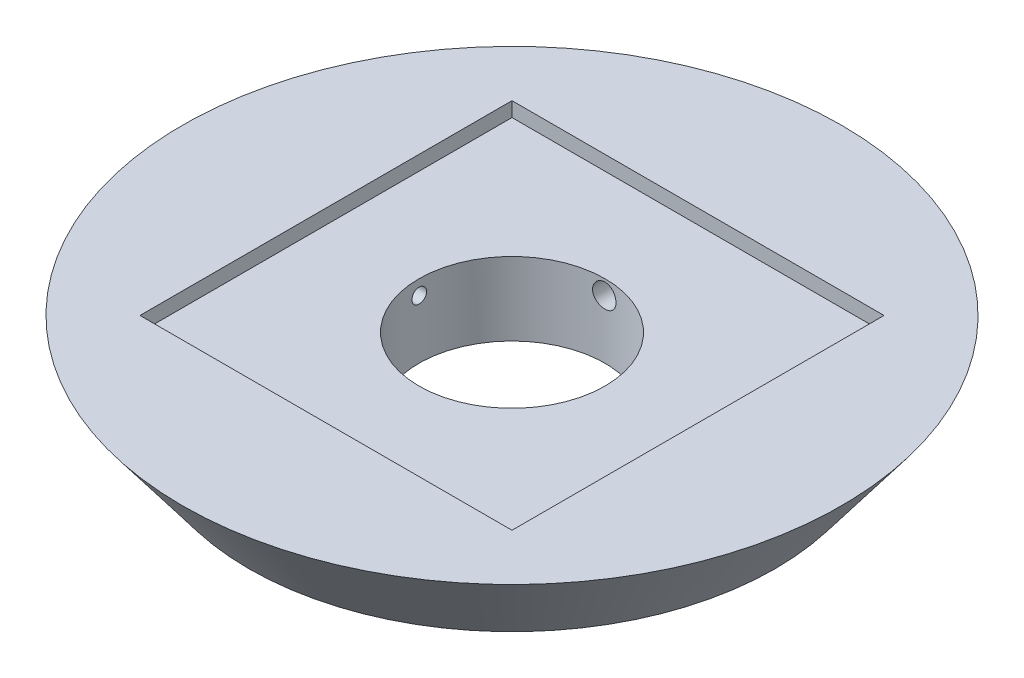
ISO-10303-21;
HEADER;
FILE_DESCRIPTION(('STEP AP214'),'2;1');
FILE_NAME('part.step','',(''),(''),'','','');
FILE_SCHEMA(('AUTOMOTIVE_DESIGN { 1 0 10303 214 1 1 1 1 }'));
ENDSEC;
DATA;
#1=APPLICATION_CONTEXT('core data for automotive mechanical design processes');
#2=APPLICATION_PROTOCOL_DEFINITION('international standard','automotive_design',2000,#1);
#3=PRODUCT_CONTEXT('',#1,'mechanical');
#4=PRODUCT('Part','Part','',(#3));
#5=PRODUCT_RELATED_PRODUCT_CATEGORY('part','',(#4));
#6=PRODUCT_DEFINITION_FORMATION('','',#4);
#7=PRODUCT_DEFINITION_CONTEXT('part definition',#1,'design');
#8=PRODUCT_DEFINITION('design','',#6,#7);
#9=PRODUCT_DEFINITION_SHAPE('','',#8);
#10=(LENGTH_UNIT() NAMED_UNIT(*) SI_UNIT(.MILLI.,.METRE.));
#11=(NAMED_UNIT(*) PLANE_ANGLE_UNIT() SI_UNIT($,.RADIAN.));
#12=(NAMED_UNIT(*) SI_UNIT($,.STERADIAN.) SOLID_ANGLE_UNIT());
#13=UNCERTAINTY_MEASURE_WITH_UNIT(LENGTH_MEASURE(1.E-05),#10,'distance_accuracy_value','');
#14=(GEOMETRIC_REPRESENTATION_CONTEXT(3) GLOBAL_UNCERTAINTY_ASSIGNED_CONTEXT((#13)) GLOBAL_UNIT_ASSIGNED_CONTEXT((#10,
#11,#12)) REPRESENTATION_CONTEXT('',''));
#15=CARTESIAN_POINT('',(0.,0.,0.));
#16=DIRECTION('',(0.,0.,1.));
#17=DIRECTION('',(1.,0.,0.));
#18=AXIS2_PLACEMENT_3D('',#15,#16,#17);
#19=CARTESIAN_POINT('',(0.,0.,0.));
#20=DIRECTION('',(0.,1.,0.));
#21=DIRECTION('',(0.,0.,1.));
#22=AXIS2_PLACEMENT_3D('',#19,#20,#21);
#23=CONICAL_SURFACE('',#22,17.96,0.647754140034402);
#24=CARTESIAN_POINT('',(-21.3203700201032,4.44269198535779,-0.23243021820478));
#25=CARTESIAN_POINT('',(-21.3097161610648,4.42898880694021,-0.258527704933812));
#26=CARTESIAN_POINT('',(-21.297481190965,4.41323547278915,-0.282908393542698));
#27=CARTESIAN_POINT('',(-21.2706260002389,4.37859909560427,-0.32782724997899));
#28=CARTESIAN_POINT('',(-21.2560018445095,4.35971088845442,-0.348358956472008));
#29=CARTESIAN_POINT('',(-21.2251610791585,4.31980157411314,-0.385305046362523));
#30=CARTESIAN_POINT('',(-21.2089587677459,4.29879956902408,-0.401752340039937));
#31=CARTESIAN_POINT('',(-21.1753733302296,4.25517551914267,-0.43078090350973));
#32=CARTESIAN_POINT('',(-21.1579905158725,4.23255390197173,-0.443363189161185));
#33=CARTESIAN_POINT('',(-21.1190121577291,4.1817176460357,-0.466803343254634));
#34=CARTESIAN_POINT('',(-21.0972490934696,4.15326372820897,-0.476864897844587));
#35=CARTESIAN_POINT('',(-21.053140090996,4.09543622807641,-0.49171567865232));
#36=CARTESIAN_POINT('',(-21.0307936956285,4.06606192062078,-0.496500634401253));
#37=CARTESIAN_POINT('',(-20.9826112539962,4.00254836263201,-0.501152843412095));
#38=CARTESIAN_POINT('',(-20.9567565632455,3.96835782304953,-0.500170823647451));
#39=CARTESIAN_POINT('',(-20.9055684806802,3.90044622421983,-0.491185632440479));
#40=CARTESIAN_POINT('',(-20.8802356566958,3.86672568806467,-0.483175187959169));
#41=CARTESIAN_POINT('',(-20.8304095740552,3.80019233188053,-0.459722927604936));
#42=CARTESIAN_POINT('',(-20.8059409705245,3.76740839515021,-0.444144560983282));
#43=CARTESIAN_POINT('',(-20.7594044752548,3.70486970257348,-0.405272666262271));
#44=CARTESIAN_POINT('',(-20.7373302473828,3.67510696596409,-0.382000194719183));
#45=CARTESIAN_POINT('',(-20.7039250152135,3.62995153707032,-0.337189366085816));
#46=CARTESIAN_POINT('',(-20.691523525966,3.61315542370973,-0.317849840981975));
#47=CARTESIAN_POINT('',(-20.6687643771143,3.58228679015061,-0.276024531751628));
#48=CARTESIAN_POINT('',(-20.6584055191492,3.56821267311835,-0.253540605681013));
#49=CARTESIAN_POINT('',(-20.6401721964658,3.54341243170321,-0.20557821394797));
#50=CARTESIAN_POINT('',(-20.6323195663698,3.53271574011488,-0.180075949750935));
#51=CARTESIAN_POINT('',(-20.6197505465356,3.51558290305499,-0.126949347366568));
#52=CARTESIAN_POINT('',(-20.6150308903946,3.50914232024459,-0.0993272529271218));
#53=CARTESIAN_POINT('',(-20.6095116930783,3.50160920840911,-0.0469699236311525));
#54=CARTESIAN_POINT('',(-20.6082564743667,3.49989505114169,-0.0223707423201863));
#55=CARTESIAN_POINT('',(-20.6084173697191,3.50011474865346,0.0267979565679116));
#56=CARTESIAN_POINT('',(-20.609832376342,3.50204709109452,0.0513674822156206));
#57=CARTESIAN_POINT('',(-20.6150390185095,3.50915321221224,0.0978914357654414));
#58=CARTESIAN_POINT('',(-20.6186485789768,3.51407864919928,0.119905439330939));
#59=CARTESIAN_POINT('',(-20.6278899805561,3.5266789138399,0.16267896786415));
#60=CARTESIAN_POINT('',(-20.6335220502428,3.53435405225198,0.18343835073041));
#61=CARTESIAN_POINT('',(-20.6469326974627,3.55261040429878,0.224443601020779));
#62=CARTESIAN_POINT('',(-20.6548158876681,3.56333308415479,0.244591673780848));
#63=CARTESIAN_POINT('',(-20.6722431242874,3.58700596186582,0.282737695691486));
#64=CARTESIAN_POINT('',(-20.6817879154564,3.59995715854605,0.300734674561981));
#65=CARTESIAN_POINT('',(-20.7037635824746,3.62973072519774,0.336940682220865));
#66=CARTESIAN_POINT('',(-20.7164126038082,3.64684237267026,0.354778456070071));
#67=CARTESIAN_POINT('',(-20.7430916189507,3.68286494602918,0.387318385631453));
#68=CARTESIAN_POINT('',(-20.7571224502575,3.70177696286262,0.402018622415071));
#69=CARTESIAN_POINT('',(-20.7890690629704,3.74475035231153,0.430861398537023));
#70=CARTESIAN_POINT('',(-20.8072081707426,3.76909571486164,0.444333378436562));
#71=CARTESIAN_POINT('',(-20.8444904871863,3.81900799922993,0.466897355663267));
#72=CARTESIAN_POINT('',(-20.8636342921076,3.84457564560691,0.475986718722012));
#73=CARTESIAN_POINT('',(-20.9061762400009,3.901247683828,0.491184039209472));
#74=CARTESIAN_POINT('',(-20.9297006875164,3.93249362566097,0.496417029969926));
#75=CARTESIAN_POINT('',(-20.9770597955014,3.99520816318676,0.500966031147946));
#76=CARTESIAN_POINT('',(-21.0008947377998,4.02667694732418,0.500276228627538));
#77=CARTESIAN_POINT('',(-21.0509581162697,4.09258164197544,0.49259312307226));
#78=CARTESIAN_POINT('',(-21.0771594883586,4.12696046438612,0.484910606290395));
#79=CARTESIAN_POINT('',(-21.1284617859713,4.19406919072746,0.462158537363277));
#80=CARTESIAN_POINT('',(-21.1535635302819,4.22680032433773,0.44709458693026));
#81=CARTESIAN_POINT('',(-21.1959890935142,4.2819698248512,0.413850568080891));
#82=CARTESIAN_POINT('',(-21.2137528907313,4.30501740089334,0.397238720270853));
#83=CARTESIAN_POINT('',(-21.2474504132472,4.34865664200211,0.359537503007624));
#84=CARTESIAN_POINT('',(-21.2633868571073,4.36925195710785,0.33845492141674));
#85=CARTESIAN_POINT('',(-21.2898693595893,4.40342339796475,0.296372493575799));
#86=CARTESIAN_POINT('',(-21.3008628989173,4.41758799189757,0.276133864625993));
#87=CARTESIAN_POINT('',(-21.3206923988726,4.44311138800045,0.232979657299166));
#88=CARTESIAN_POINT('',(-21.3295290804511,4.4544711277358,0.210064977215871));
#89=CARTESIAN_POINT('',(-21.3445907069785,4.47381949157775,0.161790587519975));
#90=CARTESIAN_POINT('',(-21.3507935555481,4.4817795977771,0.136412304952657));
#91=CARTESIAN_POINT('',(-21.3600002226482,4.49359045595212,0.084162541879302));
#92=CARTESIAN_POINT('',(-21.3630073477846,4.49744545547812,0.0572926351126244));
#93=CARTESIAN_POINT('',(-21.3653888154607,4.50049846914979,0.00690853006098983));
#94=CARTESIAN_POINT('',(-21.3652107976875,4.50027032629806,-0.0165518031352819));
#95=CARTESIAN_POINT('',(-21.3623140764917,4.49655657228593,-0.0630480362166544));
#96=CARTESIAN_POINT('',(-21.3595958916879,4.49307162605799,-0.0860840217606942));
#97=CARTESIAN_POINT('',(-21.3518839781457,4.48317857085222,-0.130562659284367));
#98=CARTESIAN_POINT('',(-21.346941640922,4.47683647608294,-0.152029218560422));
#99=CARTESIAN_POINT('',(-21.3350707357267,4.46159152076017,-0.193445665916204));
#100=CARTESIAN_POINT('',(-21.3281409760934,4.45268712383531,-0.213394634939134));
#101=CARTESIAN_POINT('',(-21.3203700201032,4.44269198535779,-0.23243021820478));
#102=B_SPLINE_CURVE_WITH_KNOTS('',3,(#24,#25,#26,#27,#28,#29,#30,#31,#32,#33,#34,#35,#36,#37,
#38,#39,#40,#41,#42,#43,#44,#45,#46,#47,#48,#49,#50,#51,#52,#53,#54,#55,#56,#57,#58,#59,#60,#61,
#62,#63,#64,#65,#66,#67,#68,#69,#70,#71,#72,#73,#74,#75,#76,#77,#78,#79,#80,#81,#82,#83,#84,#85,
#86,#87,#88,#89,#90,#91,#92,#93,#94,#95,#96,#97,#98,#99,#100,#101),.UNSPECIFIED.,.T.,.F.,(4,2,2,
2,2,2,2,2,2,2,2,2,2,2,2,2,2,2,2,2,2,2,2,2,2,2,2,2,2,2,2,2,2,2,2,2,2,2,4),(0.,0.0939242725921898,
0.188004832115099,0.281300762252269,0.374572149937963,0.485771445013495,0.597060670253336,
0.725112546928135,0.853297088628072,0.983885606516859,1.11411965926808,1.19917736129335,
1.28418501264362,1.3699142337535,1.45555393358356,1.52922493716458,1.60286539337411,
1.67110043831734,1.73934319730292,1.8115012454822,1.88369171967164,1.96668471231637,
2.0497283192277,2.14900277409493,2.24833682590413,2.36624008478252,2.48425907328037,
2.61534025825153,2.746322120441,2.84647155365229,2.94647000612785,3.02726982653083,
3.10804260168611,3.18948023206898,3.27083351688601,3.34085589575803,3.41086398147883,
3.47933148166828,3.54784012122264),.UNSPECIFIED.);
#103=CARTESIAN_POINT('',(-21.3203700201032,4.44269198535779,-0.23243021820478));
#104=VERTEX_POINT('',#103);
#105=EDGE_CURVE('E242',#104,#104,#102,.T.);
#106=ORIENTED_EDGE('',*,*,#105,.F.);
#107=EDGE_LOOP('',(#106));
#108=FACE_BOUND('',#107,.T.);
#109=CARTESIAN_POINT('',(-0.509454918054507,4.61681090159028,-21.4473370321809));
#110=CARTESIAN_POINT('',(-0.480526364803724,4.6407058353758,-21.4661096588566));
#111=CARTESIAN_POINT('',(-0.449440333462762,4.66295714474756,-21.4836296348825));
#112=CARTESIAN_POINT('',(-0.383182177380011,4.70332970599538,-21.5154668360313));
#113=CARTESIAN_POINT('',(-0.348012513327308,4.72145342574801,-21.5297859748324));
#114=CARTESIAN_POINT('',(-0.273865310924109,4.75274739270783,-21.5545381291022));
#115=CARTESIAN_POINT('',(-0.234859881918928,4.76587737092432,-21.5649395462569));
#116=CARTESIAN_POINT('',(-0.154362092693919,4.78605892397312,-21.5809366867694));
#117=CARTESIAN_POINT('',(-0.112871905401342,4.79311572913038,-21.5865365452997));
#118=CARTESIAN_POINT('',(-0.0335594627207539,4.80017608943649,-21.5921395414295));
#119=CARTESIAN_POINT('',(0.00416384986888425,4.8008705014169,-21.5926908668615));
#120=CARTESIAN_POINT('',(0.079153694511023,4.79695870948098,-21.5895861914297));
#121=CARTESIAN_POINT('',(0.11642030692301,4.79235345201464,-21.5859309418039));
#122=CARTESIAN_POINT('',(0.187289308090894,4.77855857863192,-21.5749906650464));
#123=CARTESIAN_POINT('',(0.220979824004895,4.76964208871669,-21.5679219204547));
#124=CARTESIAN_POINT('',(0.286194087547379,4.74784749072483,-21.5506625308822));
#125=CARTESIAN_POINT('',(0.317717537971148,4.73496884057399,-21.5404714587279));
#126=CARTESIAN_POINT('',(0.380756876924245,4.70452491754218,-21.5164139054591));
#127=CARTESIAN_POINT('',(0.412026683464184,4.6866463897773,-21.5023024691889));
#128=CARTESIAN_POINT('',(0.47104555372417,4.64758875733348,-21.4715299270371));
#129=CARTESIAN_POINT('',(0.498791788866195,4.62640703099255,-21.4548667961336));
#130=CARTESIAN_POINT('',(0.562195687678346,4.57131593523589,-21.4116170002272));
#131=CARTESIAN_POINT('',(0.595842844330622,4.53595070009701,-21.3839248330316));
#132=CARTESIAN_POINT('',(0.655368251048603,4.46128087449612,-21.325656711377));
#133=CARTESIAN_POINT('',(0.681234704840663,4.42197042184104,-21.2950764696296));
#134=CARTESIAN_POINT('',(0.725597482301121,4.34014735806819,-21.2316625549762));
#135=CARTESIAN_POINT('',(0.743995296514776,4.29760021803903,-21.1988050605353));
#136=CARTESIAN_POINT('',(0.773087312532638,4.21078974748785,-21.1320335959792));
#137=CARTESIAN_POINT('',(0.783782990666696,4.16652674757341,-21.0981198296289));
#138=CARTESIAN_POINT('',(0.798857172282008,4.06868083197535,-21.0234653985768));
#139=CARTESIAN_POINT('',(0.801665808182154,4.01491319212862,-20.9826423427116));
#140=CARTESIAN_POINT('',(0.796449023238213,3.90744023059234,-20.9014609542805));
#141=CARTESIAN_POINT('',(0.788409230249271,3.85373508609859,-20.8611033097818));
#142=CARTESIAN_POINT('',(0.760627058478236,3.74565012719117,-20.7802965048135));
#143=CARTESIAN_POINT('',(0.740396955447982,3.69134038040357,-20.7399178398866));
#144=CARTESIAN_POINT('',(0.687425356389677,3.58663226462874,-20.6624684990008));
#145=CARTESIAN_POINT('',(0.654712673418337,3.53622520715554,-20.6253904456522));
#146=CARTESIAN_POINT('',(0.58915397291761,3.45720702283551,-20.5675328413421));
#147=CARTESIAN_POINT('',(0.559714604966216,3.42678995097301,-20.5453395837093));
#148=CARTESIAN_POINT('',(0.495095606379711,3.37014088155484,-20.504121405809));
#149=CARTESIAN_POINT('',(0.459918746691784,3.34390687580428,-20.4850949650312));
#150=CARTESIAN_POINT('',(0.383930794486843,3.29671161205859,-20.4509431191144));
#151=CARTESIAN_POINT('',(0.343071604671762,3.27580020790895,-20.4358545669462));
#152=CARTESIAN_POINT('',(0.257014769097698,3.2409950306935,-20.4107794052384));
#153=CARTESIAN_POINT('',(0.211822439945739,3.2270927855222,-20.4007866361595));
#154=CARTESIAN_POINT('',(0.125829033427563,3.20892466173535,-20.3877362835022));
#155=CARTESIAN_POINT('',(0.0853898488842541,3.20352389755561,-20.3838616521701));
#156=CARTESIAN_POINT('',(0.00398936865404108,3.19897450316435,-20.3805974858229));
#157=CARTESIAN_POINT('',(-0.0369715889708307,3.19982201171363,-20.3812051808688));
#158=CARTESIAN_POINT('',(-0.114019935274106,3.20731373276777,-20.3865814293233));
#159=CARTESIAN_POINT('',(-0.150194296571942,3.21338698977313,-20.3909401585011));
#160=CARTESIAN_POINT('',(-0.220833689365306,3.23022673629431,-20.4030403153995));
#161=CARTESIAN_POINT('',(-0.255298677416042,3.24099334502659,-20.4107818290466));
#162=CARTESIAN_POINT('',(-0.322824066552602,3.26710335721937,-20.4295863722612));
#163=CARTESIAN_POINT('',(-0.355803958634915,3.28258248365906,-20.4407479742383));
#164=CARTESIAN_POINT('',(-0.418571184838287,3.31729497226829,-20.4658303677006));
#165=CARTESIAN_POINT('',(-0.448357277496637,3.33652978617561,-20.479752226178));
#166=CARTESIAN_POINT('',(-0.508048158396313,3.38077416051294,-20.5118521395828));
#167=CARTESIAN_POINT('',(-0.53746490566925,3.40620937840193,-20.5303482278526));
#168=CARTESIAN_POINT('',(-0.591585706908816,3.46010428193442,-20.5696573967416));
#169=CARTESIAN_POINT('',(-0.616287059396775,3.48856568684916,-20.5904717947876));
#170=CARTESIAN_POINT('',(-0.665075248767473,3.55322894819631,-20.637912367643));
#171=CARTESIAN_POINT('',(-0.688202105301176,3.58988844146563,-20.6649011756085));
#172=CARTESIAN_POINT('',(-0.727885533621121,3.66533252955009,-20.7206626818177));
#173=CARTESIAN_POINT('',(-0.744437886094315,3.70411847094416,-20.7494365119841));
#174=CARTESIAN_POINT('',(-0.773684880927065,3.79054331515575,-20.8138083874482));
#175=CARTESIAN_POINT('',(-0.785031279623049,3.83845373081555,-20.8496570469653));
#176=CARTESIAN_POINT('',(-0.798838824410245,3.93492875716989,-20.9221852168869));
#177=CARTESIAN_POINT('',(-0.801294137137781,3.98349377638254,-20.9588652568811));
#178=CARTESIAN_POINT('',(-0.797175877661465,4.08676242119729,-21.0372188580211));
#179=CARTESIAN_POINT('',(-0.789344636742554,4.14141394555891,-21.0789010663084));
#180=CARTESIAN_POINT('',(-0.762343455669578,4.24879633840061,-21.1612003972158));
#181=CARTESIAN_POINT('',(-0.743163479546287,4.30152546298573,-21.201816543849));
#182=CARTESIAN_POINT('',(-0.694205069316387,4.40130902170886,-21.2790180016387));
#183=CARTESIAN_POINT('',(-0.664869051180295,4.44850455529342,-21.3156987313236));
#184=CARTESIAN_POINT('',(-0.595270807879294,4.53742020108376,-21.3850610877103));
#185=CARTESIAN_POINT('',(-0.555041661879904,4.57915633187287,-21.4177543940249));
#186=CARTESIAN_POINT('',(-0.509454918054507,4.61681090159028,-21.4473370321809));
#187=B_SPLINE_CURVE_WITH_KNOTS('',3,(#109,#110,#111,#112,#113,#114,#115,#116,#117,#118,#119,
#120,#121,#122,#123,#124,#125,#126,#127,#128,#129,#130,#131,#132,#133,#134,#135,#136,#137,#138,
#139,#140,#141,#142,#143,#144,#145,#146,#147,#148,#149,#150,#151,#152,#153,#154,#155,#156,#157,
#158,#159,#160,#161,#162,#163,#164,#165,#166,#167,#168,#169,#170,#171,#172,#173,#174,#175,#176,
#177,#178,#179,#180,#181,#182,#183,#184,#185,#186),.UNSPECIFIED.,.T.,.F.,(4,2,2,2,2,2,2,2,2,2,2,
2,2,2,2,2,2,2,2,2,2,2,2,2,2,2,2,2,2,2,2,2,2,2,2,2,2,2,4),(0.,0.125717569335058,
0.251359773921428,0.377994682755043,0.504520421895785,0.617119434856714,0.729698342261996,
0.835929585002889,0.94217536800455,1.05779558773701,1.17350804366732,1.34096429117529,
1.50867315306078,1.67852730674676,1.84834889446017,2.05016607537407,2.25225088908781,
2.46301394654628,2.67329342222491,2.81614185571644,2.95892150309592,3.10299297955442,
3.24688989402669,3.36914347145926,3.49132150629945,3.60163390427177,3.71194910446747,
3.82580263734162,3.93970026703291,4.06840587942318,4.19718500820074,4.34980003895311,
4.50251285566183,4.6845073047942,4.86662113727951,5.07320797465817,5.27997777553959,
5.47868520628961,5.67679586111379),.UNSPECIFIED.);
#188=CARTESIAN_POINT('',(-0.509454918054507,4.61681090159028,-21.4473370321809));
#189=VERTEX_POINT('',#188);
#190=EDGE_CURVE('E202',#189,#189,#187,.T.);
#191=ORIENTED_EDGE('',*,*,#190,.F.);
#192=EDGE_LOOP('',(#191));
#193=FACE_BOUND('',#192,.T.);
#194=CARTESIAN_POINT('',(0.,6.,0.));
#195=DIRECTION('',(0.,1.,0.));
#196=DIRECTION('',(0.,0.,1.));
#197=AXIS2_PLACEMENT_3D('',#194,#195,#196);
#198=CIRCLE('',#197,22.5);
#199=CARTESIAN_POINT('',(0.,6.,22.5));
#200=VERTEX_POINT('',#199);
#201=EDGE_CURVE('E136',#200,#200,#198,.T.);
#202=ORIENTED_EDGE('',*,*,#201,.F.);
#203=EDGE_LOOP('',(#202));
#204=FACE_BOUND('',#203,.T.);
#205=CARTESIAN_POINT('',(0.,0.,0.));
#206=DIRECTION('',(0.,1.,0.));
#207=DIRECTION('',(0.,0.,1.));
#208=AXIS2_PLACEMENT_3D('',#205,#206,#207);
#209=CIRCLE('',#208,17.96);
#210=CARTESIAN_POINT('',(0.,0.,17.96));
#211=VERTEX_POINT('',#210);
#212=EDGE_CURVE('E48',#211,#211,#209,.T.);
#213=ORIENTED_EDGE('',*,*,#212,.T.);
#214=EDGE_LOOP('',(#213));
#215=FACE_BOUND('',#214,.T.);
#216=ADVANCED_FACE('F122',(#108,#193,#204,#215),#23,.T.);
#217=CARTESIAN_POINT('',(0.,6.,0.));
#218=DIRECTION('',(0.,1.,0.));
#219=DIRECTION('',(0.,0.,1.));
#220=AXIS2_PLACEMENT_3D('',#217,#218,#219);
#221=PLANE('',#220);
#222=DIRECTION('',(0.,0.,1.));
#223=VECTOR('',#222,1.);
#224=CARTESIAN_POINT('',(-12.7,6.,-12.7));
#225=LINE('',#224,#223);
#226=CARTESIAN_POINT('',(-12.7,6.,-12.7));
#227=VERTEX_POINT('',#226);
#228=CARTESIAN_POINT('',(-12.7,6.,12.7));
#229=VERTEX_POINT('',#228);
#230=EDGE_CURVE('E144',#227,#229,#225,.T.);
#231=ORIENTED_EDGE('',*,*,#230,.F.);
#232=DIRECTION('',(-1.,0.,0.));
#233=VECTOR('',#232,1.);
#234=CARTESIAN_POINT('',(12.7,6.,-12.7));
#235=LINE('',#234,#233);
#236=CARTESIAN_POINT('',(12.7,6.,-12.7));
#237=VERTEX_POINT('',#236);
#238=EDGE_CURVE('E196',#237,#227,#235,.T.);
#239=ORIENTED_EDGE('',*,*,#238,.F.);
#240=DIRECTION('',(0.,0.,-1.));
#241=VECTOR('',#240,1.);
#242=CARTESIAN_POINT('',(12.7,6.,-12.7));
#243=LINE('',#242,#241);
#244=CARTESIAN_POINT('',(12.7,6.,12.7));
#245=VERTEX_POINT('',#244);
#246=EDGE_CURVE('E204',#245,#237,#243,.T.);
#247=ORIENTED_EDGE('',*,*,#246,.F.);
#248=DIRECTION('',(1.,0.,0.));
#249=VECTOR('',#248,1.);
#250=CARTESIAN_POINT('',(12.7,6.,12.7));
#251=LINE('',#250,#249);
#252=EDGE_CURVE('E179',#229,#245,#251,.T.);
#253=ORIENTED_EDGE('',*,*,#252,.F.);
#254=EDGE_LOOP('',(#231,#239,#247,#253));
#255=FACE_BOUND('',#254,.T.);
#256=ORIENTED_EDGE('',*,*,#201,.T.);
#257=EDGE_LOOP('',(#256));
#258=FACE_BOUND('',#257,.T.);
#259=ADVANCED_FACE('F227',(#255,#258),#221,.T.);
#260=CARTESIAN_POINT('',(0.,0.,0.));
#261=DIRECTION('',(0.,1.,0.));
#262=DIRECTION('',(0.,0.,1.));
#263=AXIS2_PLACEMENT_3D('',#260,#261,#262);
#264=PLANE('',#263);
#265=CARTESIAN_POINT('',(0.,0.,0.));
#266=DIRECTION('',(0.,1.,0.));
#267=DIRECTION('',(0.,0.,1.));
#268=AXIS2_PLACEMENT_3D('',#265,#266,#267);
#269=CIRCLE('',#268,6.35);
#270=CARTESIAN_POINT('',(0.,0.,6.35));
#271=VERTEX_POINT('',#270);
#272=EDGE_CURVE('E279',#271,#271,#269,.T.);
#273=ORIENTED_EDGE('',*,*,#272,.T.);
#274=EDGE_LOOP('',(#273));
#275=FACE_BOUND('',#274,.T.);
#276=ORIENTED_EDGE('',*,*,#212,.F.);
#277=EDGE_LOOP('',(#276));
#278=FACE_BOUND('',#277,.T.);
#279=ADVANCED_FACE('F124',(#275,#278),#264,.F.);
#280=CARTESIAN_POINT('',(0.,-0.000100000000000273,0.));
#281=DIRECTION('',(0.,1.,0.));
#282=DIRECTION('',(0.,0.,1.));
#283=AXIS2_PLACEMENT_3D('',#280,#281,#282);
#284=CYLINDRICAL_SURFACE('',#283,6.35);
#285=CARTESIAN_POINT('',(-6.33028435380276,4.,-0.5));
#286=CARTESIAN_POINT('',(-6.33028461565379,3.97196152739253,-0.499998772865074));
#287=CARTESIAN_POINT('',(-6.33047264325337,3.94390383312323,-0.497633599891336));
#288=CARTESIAN_POINT('',(-6.33120445353128,3.88856437732176,-0.488233075884));
#289=CARTESIAN_POINT('',(-6.33174864199106,3.86128353791591,-0.481192397816481));
#290=CARTESIAN_POINT('',(-6.33313075722525,3.80830732668702,-0.462645408086503));
#291=CARTESIAN_POINT('',(-6.33396852025941,3.78261108043817,-0.451141585345599));
#292=CARTESIAN_POINT('',(-6.33584318404108,3.73352052638718,-0.423999190792734));
#293=CARTESIAN_POINT('',(-6.33688004146242,3.7101257194266,-0.408361518295123));
#294=CARTESIAN_POINT('',(-6.3390387544953,3.66624191511738,-0.373356254209337));
#295=CARTESIAN_POINT('',(-6.34016077945403,3.64575895286061,-0.353981106595227));
#296=CARTESIAN_POINT('',(-6.34236184750054,3.60833208313113,-0.312066802653869));
#297=CARTESIAN_POINT('',(-6.34344088872995,3.59138832853907,-0.289527509717554));
#298=CARTESIAN_POINT('',(-6.34543598840519,3.56150104962237,-0.241889083557954));
#299=CARTESIAN_POINT('',(-6.34635183517656,3.54856270479004,-0.216786691216645));
#300=CARTESIAN_POINT('',(-6.34791553684534,3.52708665167643,-0.164757392474969));
#301=CARTESIAN_POINT('',(-6.34856339598613,3.5185488737148,-0.137830514971872));
#302=CARTESIAN_POINT('',(-6.34951694489143,3.50613356676812,-0.0829763272405592));
#303=CARTESIAN_POINT('',(-6.34982334739502,3.50224632923041,-0.0550512269623212));
#304=CARTESIAN_POINT('',(-6.35006187196304,3.49921244234602,0.00105664261239814));
#305=CARTESIAN_POINT('',(-6.3499940003171,3.50006571333589,0.0292394075709214));
#306=CARTESIAN_POINT('',(-6.34949221346101,3.50648066668421,0.0849967894983198));
#307=CARTESIAN_POINT('',(-6.34905910993789,3.51203190842516,0.11257261599265));
#308=CARTESIAN_POINT('',(-6.34787651840706,3.5276689974206,0.166399873272641));
#309=CARTESIAN_POINT('',(-6.34712702766405,3.53775488387915,0.192651292606023));
#310=CARTESIAN_POINT('',(-6.34539459950869,3.56218664311999,0.243117850589004));
#311=CARTESIAN_POINT('',(-6.34441140535132,3.57653720541651,0.267330709790916));
#312=CARTESIAN_POINT('',(-6.34232210010317,3.60908755059045,0.313007951658047));
#313=CARTESIAN_POINT('',(-6.3412159867909,3.62728740304079,0.334472284634542));
#314=CARTESIAN_POINT('',(-6.33900165228437,3.66707857562583,0.37410419933174));
#315=CARTESIAN_POINT('',(-6.33789343351594,3.68867896548405,0.392262676255313));
#316=CARTESIAN_POINT('',(-6.33580281865034,3.73462640872279,0.424697119928861));
#317=CARTESIAN_POINT('',(-6.33482042264148,3.75897346403121,0.43897308395364));
#318=CARTESIAN_POINT('',(-6.33309247785042,3.80972935965906,0.463236839352351));
#319=CARTESIAN_POINT('',(-6.33234695396276,3.83613841632558,0.473224180043495));
#320=CARTESIAN_POINT('',(-6.33117762276067,3.89026570638325,0.488620555831554));
#321=CARTESIAN_POINT('',(-6.33075380941639,3.9179839152265,0.494029676738666));
#322=CARTESIAN_POINT('',(-6.33027683841511,3.97386308235356,0.500104586685361));
#323=CARTESIAN_POINT('',(-6.33022268938721,4.00202265328767,0.500783062539068));
#324=CARTESIAN_POINT('',(-6.33048856012271,4.05805514713995,0.497410635044699));
#325=CARTESIAN_POINT('',(-6.33080857677547,4.08592807243921,0.49335977101401));
#326=CARTESIAN_POINT('',(-6.33178581561373,4.14055977750872,0.48065422018676));
#327=CARTESIAN_POINT('',(-6.33244260550044,4.16731993818523,0.472005434986664));
#328=CARTESIAN_POINT('',(-6.33401902461955,4.21900923015889,0.450355542986374));
#329=CARTESIAN_POINT('',(-6.33493865762379,4.24393833517359,0.437354373728186));
#330=CARTESIAN_POINT('',(-6.33693954476435,4.29131598037746,0.407336588235897));
#331=CARTESIAN_POINT('',(-6.33802113785635,4.31375914231446,0.390311506335094));
#332=CARTESIAN_POINT('',(-6.34022291810006,4.35547350918386,0.352741424598644));
#333=CARTESIAN_POINT('',(-6.34134310584521,4.37474466531742,0.3321963706209));
#334=CARTESIAN_POINT('',(-6.34349879632339,4.40961117772874,0.288114773273303));
#335=CARTESIAN_POINT('',(-6.3445341060216,4.4251982991706,0.264571705794236));
#336=CARTESIAN_POINT('',(-6.34640060916186,4.45219781705504,0.215194961693765));
#337=CARTESIAN_POINT('',(-6.34723180445485,4.46361025135461,0.189361305846563));
#338=CARTESIAN_POINT('',(-6.34859553027769,4.48192225053915,0.13616640251973));
#339=CARTESIAN_POINT('',(-6.34912839964895,4.48882693685452,0.10880692709472));
#340=CARTESIAN_POINT('',(-6.34983680416288,4.49794418533017,0.0533126350296331));
#341=CARTESIAN_POINT('',(-6.35001234527235,4.50015682583997,0.0251778313442209));
#342=CARTESIAN_POINT('',(-6.34998632624044,4.4998263023341,-0.0309872243312377));
#343=CARTESIAN_POINT('',(-6.34978578472164,4.49729598466436,-0.0590175532897957));
#344=CARTESIAN_POINT('',(-6.34903215272085,4.48757812316702,-0.114253886143829));
#345=CARTESIAN_POINT('',(-6.34847906171985,4.48039057248316,-0.141459888825692));
#346=CARTESIAN_POINT('',(-6.34708241321677,4.46156545830918,-0.194276370838697));
#347=CARTESIAN_POINT('',(-6.34623886824077,4.44992808671906,-0.219886918918963));
#348=CARTESIAN_POINT('',(-6.34435576622384,4.42253519384979,-0.268792755365654));
#349=CARTESIAN_POINT('',(-6.34331621276509,4.40677974782925,-0.292088086032381));
#350=CARTESIAN_POINT('',(-6.3411544851271,4.37154979888058,-0.335767886376934));
#351=CARTESIAN_POINT('',(-6.34003210503172,4.35206582099342,-0.356144703745728));
#352=CARTESIAN_POINT('',(-6.33783296534767,4.3099483345733,-0.393346628971854));
#353=CARTESIAN_POINT('',(-6.33675621690069,4.28731406256025,-0.410170873360574));
#354=CARTESIAN_POINT('',(-6.33476824004749,4.23949905732962,-0.439810267687075));
#355=CARTESIAN_POINT('',(-6.33385729879151,4.21431402180532,-0.452618489746533));
#356=CARTESIAN_POINT('',(-6.3323076123803,4.16216115133415,-0.47380821919345));
#357=CARTESIAN_POINT('',(-6.33166855300922,4.13519541623851,-0.482194839355728));
#358=CARTESIAN_POINT('',(-6.33090011124732,4.09005759169261,-0.492156554832281));
#359=CARTESIAN_POINT('',(-6.33067025637678,4.07217618689832,-0.495093963178862));
#360=CARTESIAN_POINT('',(-6.33036229329822,4.03619919217206,-0.499016079628959));
#361=CARTESIAN_POINT('',(-6.33028418473338,4.01810360274386,-0.500000792324302));
#362=CARTESIAN_POINT('',(-6.33028435380276,4.,-0.5));
#363=B_SPLINE_CURVE_WITH_KNOTS('',3,(#285,#286,#287,#288,#289,#290,#291,#292,#293,#294,#295,
#296,#297,#298,#299,#300,#301,#302,#303,#304,#305,#306,#307,#308,#309,#310,#311,#312,#313,#314,
#315,#316,#317,#318,#319,#320,#321,#322,#323,#324,#325,#326,#327,#328,#329,#330,#331,#332,#333,
#334,#335,#336,#337,#338,#339,#340,#341,#342,#343,#344,#345,#346,#347,#348,#349,#350,#351,#352,
#353,#354,#355,#356,#357,#358,#359,#360,#361,#362),.UNSPECIFIED.,.T.,.F.,(4,2,2,2,2,2,2,2,2,2,2,
2,2,2,2,2,2,2,2,2,2,2,2,2,2,2,2,2,2,2,2,2,2,2,2,2,2,2,4),(0.,0.084049320744219,0.16819456770784,
0.252292957444521,0.336373066706263,0.420624976183527,0.504880524278882,0.589244574497331,
0.673607288820382,0.757793576963282,0.841978450373889,0.925976723873205,1.00997572358939,
1.09406743406179,1.17816066455614,1.26248210713564,1.34680360890152,1.43113396967687,
1.51546274980181,1.59956528668155,1.68366712437946,1.76766127406151,1.85165662913605,
1.93583029512359,2.02000525593622,2.10436662826814,2.18872723557346,2.2729918298922,
2.35725501711853,2.44129030644539,2.52532571948699,2.60935750888235,2.69338776268806,
2.77763446036561,2.86190161106664,2.94631333789622,3.03062724271587,3.08489550165564,
3.13916363298169),.UNSPECIFIED.);
#364=CARTESIAN_POINT('',(-6.33028435380276,4.,-0.5));
#365=VERTEX_POINT('',#364);
#366=EDGE_CURVE('E127',#365,#365,#363,.T.);
#367=ORIENTED_EDGE('',*,*,#366,.T.);
#368=EDGE_LOOP('',(#367));
#369=FACE_BOUND('',#368,.T.);
#370=CARTESIAN_POINT('',(0.8,4.,-6.29940473378239));
#371=CARTESIAN_POINT('',(0.799998099422212,3.95525537976419,-6.29940538095697));
#372=CARTESIAN_POINT('',(0.796233430173549,3.91048286559584,-6.2998866127922));
#373=CARTESIAN_POINT('',(0.781275060993574,3.82218407116655,-6.30175879467612));
#374=CARTESIAN_POINT('',(0.770073616614772,3.77865913944485,-6.30315069304523));
#375=CARTESIAN_POINT('',(0.740577343715408,3.69414670474073,-6.30668410673966));
#376=CARTESIAN_POINT('',(0.722287352127578,3.65315749355593,-6.30882511080945));
#377=CARTESIAN_POINT('',(0.679143560842018,3.57483771625047,-6.31361488299485));
#378=CARTESIAN_POINT('',(0.654290875333756,3.5375065305577,-6.31626356489792));
#379=CARTESIAN_POINT('',(0.598575901029557,3.46734278194852,-6.32178710906937));
#380=CARTESIAN_POINT('',(0.567683749127753,3.43453401481398,-6.32466305113923));
#381=CARTESIAN_POINT('',(0.500831046498409,3.37455199520221,-6.33030736102771));
#382=CARTESIAN_POINT('',(0.464870242845289,3.34737902411838,-6.33307572346931));
#383=CARTESIAN_POINT('',(0.388751372738061,3.29935449838057,-6.33820401216533));
#384=CARTESIAN_POINT('',(0.348579608202727,3.27852449253169,-6.34056253468429));
#385=CARTESIAN_POINT('',(0.265273459315723,3.24391521715425,-6.34459353105119));
#386=CARTESIAN_POINT('',(0.222139186655101,3.23013568197759,-6.34626603074667));
#387=CARTESIAN_POINT('',(0.134375869469567,3.21008963158737,-6.34872893103278));
#388=CARTESIAN_POINT('',(0.089755996161743,3.20378354378542,-6.34952397627067));
#389=CARTESIAN_POINT('',(8.47129395961272E-05,3.19874074528802,-6.35015824995215));
#390=CARTESIAN_POINT('',(-0.0449666796735323,3.20000373237835,-6.3499975165576));
#391=CARTESIAN_POINT('',(-0.133952891165184,3.21003153525597,-6.34874209970502));
#392=CARTESIAN_POINT('',(-0.177892591373677,3.21875379108107,-6.34765271491796));
#393=CARTESIAN_POINT('',(-0.263679570258819,3.24338599873208,-6.34466835044893));
#394=CARTESIAN_POINT('',(-0.305526808609213,3.25929608902381,-6.34277335524779));
#395=CARTESIAN_POINT('',(-0.386072624815213,3.29789753487073,-6.33838157030118));
#396=CARTESIAN_POINT('',(-0.424762292045589,3.32060729044988,-6.33588315127214));
#397=CARTESIAN_POINT('',(-0.497797508007895,3.37215003301921,-6.3305639992234));
#398=CARTESIAN_POINT('',(-0.53214285425168,3.40098330525789,-6.32774325119164));
#399=CARTESIAN_POINT('',(-0.595764557194862,3.46419293489589,-6.32207196292732));
#400=CARTESIAN_POINT('',(-0.625004066523857,3.498606385934,-6.31922135181857));
#401=CARTESIAN_POINT('',(-0.677297666794482,3.57187212674246,-6.31383093957604));
#402=CARTESIAN_POINT('',(-0.700351737790645,3.61072443082568,-6.3112911394445));
#403=CARTESIAN_POINT('',(-0.739622253033648,3.69179803834019,-6.30680994223799));
#404=CARTESIAN_POINT('',(-0.755835715183207,3.73402080157199,-6.30486880624385));
#405=CARTESIAN_POINT('',(-0.78093193574943,3.82061958298294,-6.30180978847408));
#406=CARTESIAN_POINT('',(-0.789815053237903,3.8649954955788,-6.30069186637419));
#407=CARTESIAN_POINT('',(-0.799949563619758,3.95431538585054,-6.29941323072818));
#408=CARTESIAN_POINT('',(-0.801252825839793,3.99925338866889,-6.29924601165157));
#409=CARTESIAN_POINT('',(-0.796327517341681,4.08870709725101,-6.29987050702912));
#410=CARTESIAN_POINT('',(-0.790099109763871,4.13322281214073,-6.30066220071267));
#411=CARTESIAN_POINT('',(-0.770330947568634,4.22041267623645,-6.30310937948624));
#412=CARTESIAN_POINT('',(-0.756816335306293,4.26309261644278,-6.30476189350261));
#413=CARTESIAN_POINT('',(-0.722885285235996,4.34558062444888,-6.30874210485505));
#414=CARTESIAN_POINT('',(-0.702468601312878,4.3853885897779,-6.31106982626735));
#415=CARTESIAN_POINT('',(-0.655185537111616,4.4612372411747,-6.31615374955529));
#416=CARTESIAN_POINT('',(-0.628285157978373,4.49725658083096,-6.3189121821861));
#417=CARTESIAN_POINT('',(-0.568846339001079,4.56428766174751,-6.32453972700497));
#418=CARTESIAN_POINT('',(-0.53630767631506,4.59529920499095,-6.3274088435641));
#419=CARTESIAN_POINT('',(-0.466289291403511,4.65161674483547,-6.33295447404682));
#420=CARTESIAN_POINT('',(-0.428782036839782,4.67688864750934,-6.33562977590244));
#421=CARTESIAN_POINT('',(-0.350024966497641,4.72077356188104,-6.34046819043956));
#422=CARTESIAN_POINT('',(-0.308775227195423,4.73938670960947,-6.34263131358397));
#423=CARTESIAN_POINT('',(-0.22381716212906,4.76936952068993,-6.34619626695759));
#424=CARTESIAN_POINT('',(-0.180115866860321,4.7807588496326,-6.34760016250123));
#425=CARTESIAN_POINT('',(-0.0914023674292076,4.7960346842415,-6.34949705885847));
#426=CARTESIAN_POINT('',(-0.0463902234590148,4.7999215338605,-6.34999010143029));
#427=CARTESIAN_POINT('',(0.043334421793079,4.80007557784065,-6.35000953459927));
#428=CARTESIAN_POINT('',(0.0880468404993518,4.79639532890888,-6.34954259269818));
#429=CARTESIAN_POINT('',(0.176212290420105,4.78163100538533,-6.3477077833403));
#430=CARTESIAN_POINT('',(0.21966532260755,4.77054693651366,-6.34633991657956));
#431=CARTESIAN_POINT('',(0.304071365820108,4.74130619172236,-6.34285627073992));
#432=CARTESIAN_POINT('',(0.345025275010136,4.72315207424477,-6.34074076223611));
#433=CARTESIAN_POINT('',(0.423313651609688,4.68029200866156,-6.33599601402998));
#434=CARTESIAN_POINT('',(0.460648073228484,4.65558597768137,-6.33336676782954));
#435=CARTESIAN_POINT('',(0.530906127968341,4.60012909932086,-6.3278662032916));
#436=CARTESIAN_POINT('',(0.563798784967199,4.56933915421177,-6.32499339172657));
#437=CARTESIAN_POINT('',(0.623970956505612,4.50266972692639,-6.31934142836514));
#438=CARTESIAN_POINT('',(0.651249140199305,4.4667890414462,-6.31656229890524));
#439=CARTESIAN_POINT('',(0.699509728478261,4.39079507394165,-6.31140073963325));
#440=CARTESIAN_POINT('',(0.720467020981436,4.35066574332563,-6.30901990845433));
#441=CARTESIAN_POINT('',(0.75531530044066,4.26744957509094,-6.30494324949725));
#442=CARTESIAN_POINT('',(0.769213960217184,4.22436600685776,-6.30324667833493));
#443=CARTESIAN_POINT('',(0.786229194505384,4.15088373359646,-6.30114185496126));
#444=CARTESIAN_POINT('',(0.791385803434391,4.12094820605224,-6.30049368629304));
#445=CARTESIAN_POINT('',(0.798271837384133,4.06067939368853,-6.29962490790246));
#446=CARTESIAN_POINT('',(0.800001288985046,4.03034611195576,-6.2994042948641));
#447=CARTESIAN_POINT('',(0.8,4.,-6.29940473378239));
#448=B_SPLINE_CURVE_WITH_KNOTS('',3,(#370,#371,#372,#373,#374,#375,#376,#377,#378,#379,#380,
#381,#382,#383,#384,#385,#386,#387,#388,#389,#390,#391,#392,#393,#394,#395,#396,#397,#398,#399,
#400,#401,#402,#403,#404,#405,#406,#407,#408,#409,#410,#411,#412,#413,#414,#415,#416,#417,#418,
#419,#420,#421,#422,#423,#424,#425,#426,#427,#428,#429,#430,#431,#432,#433,#434,#435,#436,#437,
#438,#439,#440,#441,#442,#443,#444,#445,#446,#447),.UNSPECIFIED.,.T.,.F.,(4,2,2,2,2,2,2,2,2,2,2,
2,2,2,2,2,2,2,2,2,2,2,2,2,2,2,2,2,2,2,2,2,2,2,2,2,2,2,4),(0.,0.134122999114913,
0.268385889672416,0.402557325606907,0.536705997049322,0.671535577050757,0.806371887427913,
0.941661290802616,1.07694559635859,1.21151031215893,1.34606965516266,1.47986633331685,
1.61366558902869,1.74783023155488,1.88200112517226,2.01710351287081,2.15220633621315,
2.28736799562131,2.422523033837,2.55675210110795,2.69097826095152,2.82474418644797,
2.95851488229409,3.09300291209318,3.2274962584776,3.36276874663435,3.49803847117374,
3.63293834871838,3.76783204160221,3.90179200590258,4.03575186670676,4.16966329636512,
4.30357641993783,4.4383798845103,4.573215265976,4.7085794809445,4.84379623670879,
4.93476009097038,5.02572323973627),.UNSPECIFIED.);
#449=CARTESIAN_POINT('',(0.8,4.,-6.29940473378239));
#450=VERTEX_POINT('',#449);
#451=EDGE_CURVE('E241',#450,#450,#448,.T.);
#452=ORIENTED_EDGE('',*,*,#451,.T.);
#453=EDGE_LOOP('',(#452));
#454=FACE_BOUND('',#453,.T.);
#455=CARTESIAN_POINT('',(0.,5.,0.));
#456=DIRECTION('',(0.,-1.,0.));
#457=DIRECTION('',(0.,0.,-1.));
#458=AXIS2_PLACEMENT_3D('',#455,#456,#457);
#459=CIRCLE('',#458,6.35);
#460=CARTESIAN_POINT('',(0.,5.,-6.35));
#461=VERTEX_POINT('',#460);
#462=EDGE_CURVE('E208',#461,#461,#459,.F.);
#463=ORIENTED_EDGE('',*,*,#462,.T.);
#464=EDGE_LOOP('',(#463));
#465=FACE_BOUND('',#464,.T.);
#466=ORIENTED_EDGE('',*,*,#272,.F.);
#467=EDGE_LOOP('',(#466));
#468=FACE_BOUND('',#467,.T.);
#469=ADVANCED_FACE('F259',(#369,#454,#465,#468),#284,.F.);
#470=CARTESIAN_POINT('',(0.,5.,0.));
#471=DIRECTION('',(0.,-1.,0.));
#472=DIRECTION('',(0.,0.,-1.));
#473=AXIS2_PLACEMENT_3D('',#470,#471,#472);
#474=PLANE('',#473);
#475=DIRECTION('',(0.,0.,1.));
#476=VECTOR('',#475,1.);
#477=CARTESIAN_POINT('',(-12.7,5.,-12.7));
#478=LINE('',#477,#476);
#479=CARTESIAN_POINT('',(-12.7,5.,-12.7));
#480=VERTEX_POINT('',#479);
#481=CARTESIAN_POINT('',(-12.7,5.,12.7));
#482=VERTEX_POINT('',#481);
#483=EDGE_CURVE('E194',#480,#482,#478,.T.);
#484=ORIENTED_EDGE('',*,*,#483,.T.);
#485=DIRECTION('',(1.,0.,0.));
#486=VECTOR('',#485,1.);
#487=CARTESIAN_POINT('',(12.7,5.,12.7));
#488=LINE('',#487,#486);
#489=CARTESIAN_POINT('',(12.7,5.,12.7));
#490=VERTEX_POINT('',#489);
#491=EDGE_CURVE('E176',#482,#490,#488,.T.);
#492=ORIENTED_EDGE('',*,*,#491,.T.);
#493=DIRECTION('',(0.,0.,-1.));
#494=VECTOR('',#493,1.);
#495=CARTESIAN_POINT('',(12.7,5.,-12.7));
#496=LINE('',#495,#494);
#497=CARTESIAN_POINT('',(12.7,5.,-12.7));
#498=VERTEX_POINT('',#497);
#499=EDGE_CURVE('E186',#490,#498,#496,.T.);
#500=ORIENTED_EDGE('',*,*,#499,.T.);
#501=DIRECTION('',(-1.,0.,0.));
#502=VECTOR('',#501,1.);
#503=CARTESIAN_POINT('',(12.7,5.,-12.7));
#504=LINE('',#503,#502);
#505=EDGE_CURVE('E190',#498,#480,#504,.T.);
#506=ORIENTED_EDGE('',*,*,#505,.T.);
#507=EDGE_LOOP('',(#484,#492,#500,#506));
#508=FACE_BOUND('',#507,.T.);
#509=ORIENTED_EDGE('',*,*,#462,.F.);
#510=EDGE_LOOP('',(#509));
#511=FACE_BOUND('',#510,.T.);
#512=ADVANCED_FACE('F192',(#508,#511),#474,.F.);
#513=CARTESIAN_POINT('',(-12.7,5.,-12.7));
#514=DIRECTION('',(-1.,0.,0.));
#515=DIRECTION('',(0.,0.,1.));
#516=AXIS2_PLACEMENT_3D('',#513,#514,#515);
#517=PLANE('',#516);
#518=ORIENTED_EDGE('',*,*,#230,.T.);
#519=DIRECTION('',(0.,1.,0.));
#520=VECTOR('',#519,1.);
#521=CARTESIAN_POINT('',(-12.7,5.,12.7));
#522=LINE('',#521,#520);
#523=EDGE_CURVE('E167',#482,#229,#522,.T.);
#524=ORIENTED_EDGE('',*,*,#523,.F.);
#525=ORIENTED_EDGE('',*,*,#483,.F.);
#526=DIRECTION('',(0.,1.,0.));
#527=VECTOR('',#526,1.);
#528=CARTESIAN_POINT('',(-12.7,5.,-12.7));
#529=LINE('',#528,#527);
#530=EDGE_CURVE('E152',#480,#227,#529,.T.);
#531=ORIENTED_EDGE('',*,*,#530,.T.);
#532=EDGE_LOOP('',(#518,#524,#525,#531));
#533=FACE_BOUND('',#532,.T.);
#534=ADVANCED_FACE('F264',(#533),#517,.F.);
#535=CARTESIAN_POINT('',(12.7,5.,-12.7));
#536=DIRECTION('',(0.,0.,-1.));
#537=DIRECTION('',(-1.,0.,0.));
#538=AXIS2_PLACEMENT_3D('',#535,#536,#537);
#539=PLANE('',#538);
#540=ORIENTED_EDGE('',*,*,#238,.T.);
#541=ORIENTED_EDGE('',*,*,#530,.F.);
#542=ORIENTED_EDGE('',*,*,#505,.F.);
#543=DIRECTION('',(0.,1.,0.));
#544=VECTOR('',#543,1.);
#545=CARTESIAN_POINT('',(12.7,5.,-12.7));
#546=LINE('',#545,#544);
#547=EDGE_CURVE('E183',#498,#237,#546,.T.);
#548=ORIENTED_EDGE('',*,*,#547,.T.);
#549=EDGE_LOOP('',(#540,#541,#542,#548));
#550=FACE_BOUND('',#549,.T.);
#551=ADVANCED_FACE('F268',(#550),#539,.F.);
#552=CARTESIAN_POINT('',(12.7,5.,-12.7));
#553=DIRECTION('',(1.,0.,0.));
#554=DIRECTION('',(0.,0.,-1.));
#555=AXIS2_PLACEMENT_3D('',#552,#553,#554);
#556=PLANE('',#555);
#557=ORIENTED_EDGE('',*,*,#246,.T.);
#558=ORIENTED_EDGE('',*,*,#547,.F.);
#559=ORIENTED_EDGE('',*,*,#499,.F.);
#560=DIRECTION('',(0.,1.,0.));
#561=VECTOR('',#560,1.);
#562=CARTESIAN_POINT('',(12.7,5.,12.7));
#563=LINE('',#562,#561);
#564=EDGE_CURVE('E172',#490,#245,#563,.T.);
#565=ORIENTED_EDGE('',*,*,#564,.T.);
#566=EDGE_LOOP('',(#557,#558,#559,#565));
#567=FACE_BOUND('',#566,.T.);
#568=ADVANCED_FACE('F187',(#567),#556,.F.);
#569=CARTESIAN_POINT('',(12.7,5.,12.7));
#570=DIRECTION('',(0.,0.,1.));
#571=DIRECTION('',(1.,0.,0.));
#572=AXIS2_PLACEMENT_3D('',#569,#570,#571);
#573=PLANE('',#572);
#574=ORIENTED_EDGE('',*,*,#252,.T.);
#575=ORIENTED_EDGE('',*,*,#564,.F.);
#576=ORIENTED_EDGE('',*,*,#491,.F.);
#577=ORIENTED_EDGE('',*,*,#523,.T.);
#578=EDGE_LOOP('',(#574,#575,#576,#577));
#579=FACE_BOUND('',#578,.T.);
#580=ADVANCED_FACE('F174',(#579),#573,.F.);
#581=CARTESIAN_POINT('',(0.,4.,-22.5001));
#582=DIRECTION('',(0.,0.,1.));
#583=DIRECTION('',(1.,0.,0.));
#584=AXIS2_PLACEMENT_3D('',#581,#582,#583);
#585=CYLINDRICAL_SURFACE('',#584,0.8);
#586=ORIENTED_EDGE('',*,*,#190,.T.);
#587=EDGE_LOOP('',(#586));
#588=FACE_BOUND('',#587,.T.);
#589=ORIENTED_EDGE('',*,*,#451,.F.);
#590=EDGE_LOOP('',(#589));
#591=FACE_BOUND('',#590,.T.);
#592=ADVANCED_FACE('F245',(#588,#591),#585,.F.);
#593=CARTESIAN_POINT('',(-22.5001,4.,0.));
#594=DIRECTION('',(1.,0.,0.));
#595=DIRECTION('',(0.,0.,-1.));
#596=AXIS2_PLACEMENT_3D('',#593,#594,#595);
#597=CYLINDRICAL_SURFACE('',#596,0.5);
#598=ORIENTED_EDGE('',*,*,#105,.T.);
#599=EDGE_LOOP('',(#598));
#600=FACE_BOUND('',#599,.T.);
#601=ORIENTED_EDGE('',*,*,#366,.F.);
#602=EDGE_LOOP('',(#601));
#603=FACE_BOUND('',#602,.T.);
#604=ADVANCED_FACE('F249',(#600,#603),#597,.F.);
#605=CLOSED_SHELL('',(#216,#259,#279,#469,#512,#534,#551,#568,#580,#592,#604));
#606=MANIFOLD_SOLID_BREP('B7',#605);
#607=ADVANCED_BREP_SHAPE_REPRESENTATION('',(#18,#606),#14);
#608=SHAPE_DEFINITION_REPRESENTATION(#9,#607);
ENDSEC;
END-ISO-10303-21;
